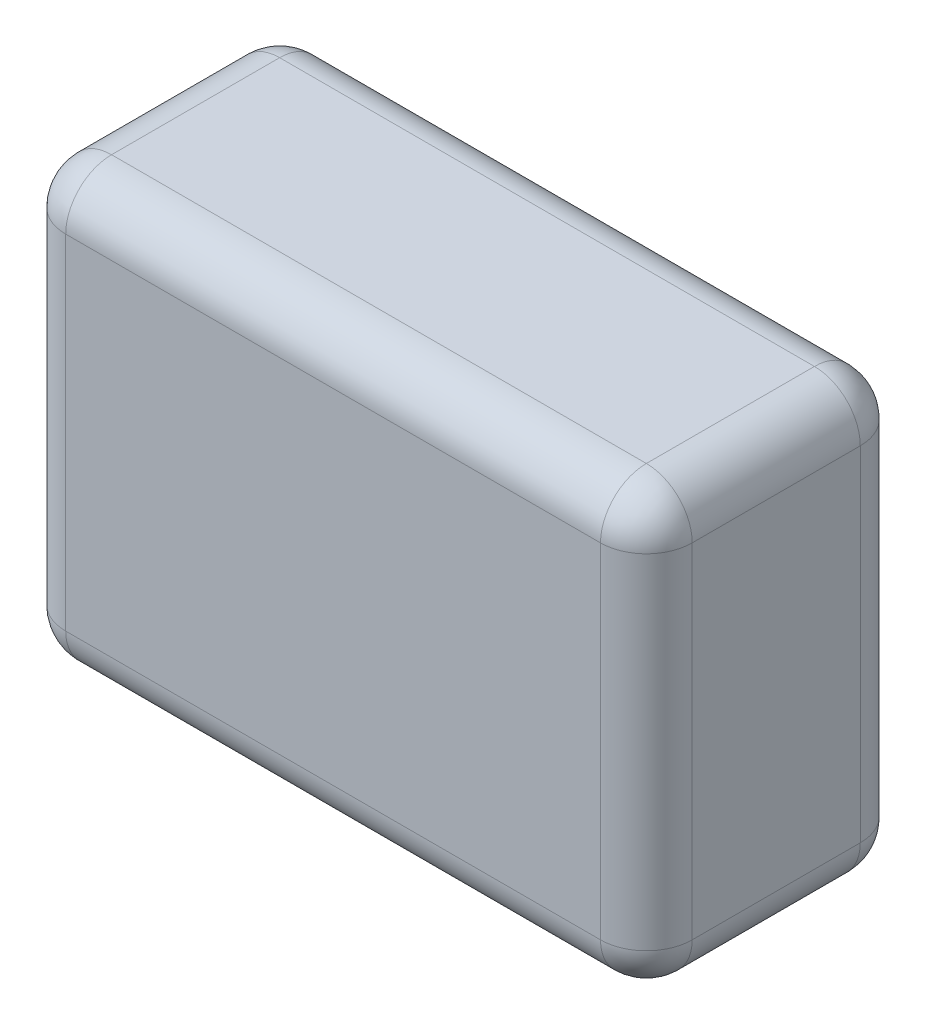
ISO-10303-21;
HEADER;
FILE_DESCRIPTION(('STEP AP214'),'2;1');
FILE_NAME('part.step','',(''),(''),'','','');
FILE_SCHEMA(('AUTOMOTIVE_DESIGN { 1 0 10303 214 1 1 1 1 }'));
ENDSEC;
DATA;
#1=APPLICATION_CONTEXT('core data for automotive mechanical design processes');
#2=APPLICATION_PROTOCOL_DEFINITION('international standard','automotive_design',2000,#1);
#3=PRODUCT_CONTEXT('',#1,'mechanical');
#4=PRODUCT('Part','Part','',(#3));
#5=PRODUCT_RELATED_PRODUCT_CATEGORY('part','',(#4));
#6=PRODUCT_DEFINITION_FORMATION('','',#4);
#7=PRODUCT_DEFINITION_CONTEXT('part definition',#1,'design');
#8=PRODUCT_DEFINITION('design','',#6,#7);
#9=PRODUCT_DEFINITION_SHAPE('','',#8);
#10=(LENGTH_UNIT() NAMED_UNIT(*) SI_UNIT(.MILLI.,.METRE.));
#11=(NAMED_UNIT(*) PLANE_ANGLE_UNIT() SI_UNIT($,.RADIAN.));
#12=(NAMED_UNIT(*) SI_UNIT($,.STERADIAN.) SOLID_ANGLE_UNIT());
#13=UNCERTAINTY_MEASURE_WITH_UNIT(LENGTH_MEASURE(1.E-05),#10,'distance_accuracy_value','');
#14=(GEOMETRIC_REPRESENTATION_CONTEXT(3) GLOBAL_UNCERTAINTY_ASSIGNED_CONTEXT((#13)) GLOBAL_UNIT_ASSIGNED_CONTEXT((#10,
#11,#12)) REPRESENTATION_CONTEXT('',''));
#15=CARTESIAN_POINT('',(0.,0.,0.));
#16=DIRECTION('',(0.,0.,1.));
#17=DIRECTION('',(1.,0.,0.));
#18=AXIS2_PLACEMENT_3D('',#15,#16,#17);
#19=CARTESIAN_POINT('',(-41.,28.5,-17.));
#20=DIRECTION('',(1.,0.,0.));
#21=DIRECTION('',(0.,0.,-1.));
#22=AXIS2_PLACEMENT_3D('',#19,#20,#21);
#23=PLANE('',#22);
#24=DIRECTION('',(0.,-1.,0.));
#25=VECTOR('',#24,1.);
#26=CARTESIAN_POINT('',(-41.,28.5,11.));
#27=LINE('',#26,#25);
#28=CARTESIAN_POINT('',(-41.,-22.5,11.));
#29=VERTEX_POINT('',#28);
#30=CARTESIAN_POINT('',(-41.,22.5,11.));
#31=VERTEX_POINT('',#30);
#32=EDGE_CURVE('E138',#29,#31,#27,.F.);
#33=ORIENTED_EDGE('',*,*,#32,.T.);
#34=DIRECTION('',(0.,0.,1.));
#35=VECTOR('',#34,1.);
#36=CARTESIAN_POINT('',(-41.,22.5,-17.));
#37=LINE('',#36,#35);
#38=CARTESIAN_POINT('',(-41.,22.5,-11.));
#39=VERTEX_POINT('',#38);
#40=EDGE_CURVE('E175',#31,#39,#37,.F.);
#41=ORIENTED_EDGE('',*,*,#40,.T.);
#42=DIRECTION('',(0.,-1.,0.));
#43=VECTOR('',#42,1.);
#44=CARTESIAN_POINT('',(-41.,28.5,-11.));
#45=LINE('',#44,#43);
#46=CARTESIAN_POINT('',(-41.,-22.5,-11.));
#47=VERTEX_POINT('',#46);
#48=EDGE_CURVE('E172',#39,#47,#45,.T.);
#49=ORIENTED_EDGE('',*,*,#48,.T.);
#50=DIRECTION('',(0.,0.,1.));
#51=VECTOR('',#50,1.);
#52=CARTESIAN_POINT('',(-41.,-22.5,-17.));
#53=LINE('',#52,#51);
#54=EDGE_CURVE('E167',#47,#29,#53,.T.);
#55=ORIENTED_EDGE('',*,*,#54,.T.);
#56=EDGE_LOOP('',(#33,#41,#49,#55));
#57=FACE_BOUND('',#56,.T.);
#58=ADVANCED_FACE('F43',(#57),#23,.F.);
#59=CARTESIAN_POINT('',(-41.,28.5,17.));
#60=DIRECTION('',(0.,0.,-1.));
#61=DIRECTION('',(-1.,0.,0.));
#62=AXIS2_PLACEMENT_3D('',#59,#60,#61);
#63=PLANE('',#62);
#64=DIRECTION('',(0.,-1.,0.));
#65=VECTOR('',#64,1.);
#66=CARTESIAN_POINT('',(35.,28.5,17.));
#67=LINE('',#66,#65);
#68=CARTESIAN_POINT('',(35.,-22.5,17.));
#69=VERTEX_POINT('',#68);
#70=CARTESIAN_POINT('',(35.,22.5,17.));
#71=VERTEX_POINT('',#70);
#72=EDGE_CURVE('E160',#69,#71,#67,.F.);
#73=ORIENTED_EDGE('',*,*,#72,.T.);
#74=DIRECTION('',(1.,0.,0.));
#75=VECTOR('',#74,1.);
#76=CARTESIAN_POINT('',(-41.,22.5,17.));
#77=LINE('',#76,#75);
#78=CARTESIAN_POINT('',(-35.,22.5,17.));
#79=VERTEX_POINT('',#78);
#80=EDGE_CURVE('E164',#71,#79,#77,.F.);
#81=ORIENTED_EDGE('',*,*,#80,.T.);
#82=DIRECTION('',(0.,-1.,0.));
#83=VECTOR('',#82,1.);
#84=CARTESIAN_POINT('',(-35.,28.5,17.));
#85=LINE('',#84,#83);
#86=CARTESIAN_POINT('',(-35.,-22.5,17.));
#87=VERTEX_POINT('',#86);
#88=EDGE_CURVE('E136',#79,#87,#85,.T.);
#89=ORIENTED_EDGE('',*,*,#88,.T.);
#90=DIRECTION('',(1.,0.,0.));
#91=VECTOR('',#90,1.);
#92=CARTESIAN_POINT('',(-41.,-22.5,17.));
#93=LINE('',#92,#91);
#94=EDGE_CURVE('E154',#87,#69,#93,.T.);
#95=ORIENTED_EDGE('',*,*,#94,.T.);
#96=EDGE_LOOP('',(#73,#81,#89,#95));
#97=FACE_BOUND('',#96,.T.);
#98=ADVANCED_FACE('F162',(#97),#63,.F.);
#99=CARTESIAN_POINT('',(41.,28.5,-17.));
#100=DIRECTION('',(-1.,0.,0.));
#101=DIRECTION('',(0.,0.,1.));
#102=AXIS2_PLACEMENT_3D('',#99,#100,#101);
#103=PLANE('',#102);
#104=DIRECTION('',(0.,-1.,0.));
#105=VECTOR('',#104,1.);
#106=CARTESIAN_POINT('',(41.,28.5,-11.));
#107=LINE('',#106,#105);
#108=CARTESIAN_POINT('',(41.,-22.5,-11.));
#109=VERTEX_POINT('',#108);
#110=CARTESIAN_POINT('',(41.,22.5,-11.));
#111=VERTEX_POINT('',#110);
#112=EDGE_CURVE('E179',#109,#111,#107,.F.);
#113=ORIENTED_EDGE('',*,*,#112,.T.);
#114=DIRECTION('',(0.,0.,-1.));
#115=VECTOR('',#114,1.);
#116=CARTESIAN_POINT('',(41.,22.5,17.));
#117=LINE('',#116,#115);
#118=CARTESIAN_POINT('',(41.,22.5,11.));
#119=VERTEX_POINT('',#118);
#120=EDGE_CURVE('E184',#111,#119,#117,.F.);
#121=ORIENTED_EDGE('',*,*,#120,.T.);
#122=DIRECTION('',(0.,-1.,0.));
#123=VECTOR('',#122,1.);
#124=CARTESIAN_POINT('',(41.,28.5,11.));
#125=LINE('',#124,#123);
#126=CARTESIAN_POINT('',(41.,-22.5,11.));
#127=VERTEX_POINT('',#126);
#128=EDGE_CURVE('E181',#119,#127,#125,.T.);
#129=ORIENTED_EDGE('',*,*,#128,.T.);
#130=DIRECTION('',(0.,0.,-1.));
#131=VECTOR('',#130,1.);
#132=CARTESIAN_POINT('',(41.,-22.5,-17.));
#133=LINE('',#132,#131);
#134=EDGE_CURVE('E177',#127,#109,#133,.T.);
#135=ORIENTED_EDGE('',*,*,#134,.T.);
#136=EDGE_LOOP('',(#113,#121,#129,#135));
#137=FACE_BOUND('',#136,.T.);
#138=ADVANCED_FACE('F289',(#137),#103,.F.);
#139=CARTESIAN_POINT('',(-41.,28.5,-17.));
#140=DIRECTION('',(0.,0.,1.));
#141=DIRECTION('',(1.,0.,0.));
#142=AXIS2_PLACEMENT_3D('',#139,#140,#141);
#143=PLANE('',#142);
#144=DIRECTION('',(0.,-1.,0.));
#145=VECTOR('',#144,1.);
#146=CARTESIAN_POINT('',(-35.,28.5,-17.));
#147=LINE('',#146,#145);
#148=CARTESIAN_POINT('',(-35.,-22.5,-17.));
#149=VERTEX_POINT('',#148);
#150=CARTESIAN_POINT('',(-35.,22.5,-17.));
#151=VERTEX_POINT('',#150);
#152=EDGE_CURVE('E188',#149,#151,#147,.F.);
#153=ORIENTED_EDGE('',*,*,#152,.T.);
#154=DIRECTION('',(-1.,0.,0.));
#155=VECTOR('',#154,1.);
#156=CARTESIAN_POINT('',(41.,22.5,-17.));
#157=LINE('',#156,#155);
#158=CARTESIAN_POINT('',(35.,22.5,-17.));
#159=VERTEX_POINT('',#158);
#160=EDGE_CURVE('E193',#151,#159,#157,.F.);
#161=ORIENTED_EDGE('',*,*,#160,.T.);
#162=DIRECTION('',(0.,-1.,0.));
#163=VECTOR('',#162,1.);
#164=CARTESIAN_POINT('',(35.,28.5,-17.));
#165=LINE('',#164,#163);
#166=CARTESIAN_POINT('',(35.,-22.5,-17.));
#167=VERTEX_POINT('',#166);
#168=EDGE_CURVE('E190',#159,#167,#165,.T.);
#169=ORIENTED_EDGE('',*,*,#168,.T.);
#170=DIRECTION('',(-1.,0.,0.));
#171=VECTOR('',#170,1.);
#172=CARTESIAN_POINT('',(-41.,-22.5,-17.));
#173=LINE('',#172,#171);
#174=EDGE_CURVE('E186',#167,#149,#173,.T.);
#175=ORIENTED_EDGE('',*,*,#174,.T.);
#176=EDGE_LOOP('',(#153,#161,#169,#175));
#177=FACE_BOUND('',#176,.T.);
#178=ADVANCED_FACE('F299',(#177),#143,.F.);
#179=CARTESIAN_POINT('',(0.,28.5,0.));
#180=DIRECTION('',(0.,1.,0.));
#181=DIRECTION('',(0.,0.,1.));
#182=AXIS2_PLACEMENT_3D('',#179,#180,#181);
#183=PLANE('',#182);
#184=DIRECTION('',(0.,0.,-1.));
#185=VECTOR('',#184,1.);
#186=CARTESIAN_POINT('',(35.,28.5,-17.));
#187=LINE('',#186,#185);
#188=CARTESIAN_POINT('',(35.,28.5,11.));
#189=VERTEX_POINT('',#188);
#190=CARTESIAN_POINT('',(35.,28.5,-11.));
#191=VERTEX_POINT('',#190);
#192=EDGE_CURVE('E199',#189,#191,#187,.T.);
#193=ORIENTED_EDGE('',*,*,#192,.T.);
#194=DIRECTION('',(-1.,0.,0.));
#195=VECTOR('',#194,1.);
#196=CARTESIAN_POINT('',(-41.,28.5,-11.));
#197=LINE('',#196,#195);
#198=CARTESIAN_POINT('',(-35.,28.5,-11.));
#199=VERTEX_POINT('',#198);
#200=EDGE_CURVE('E201',#191,#199,#197,.T.);
#201=ORIENTED_EDGE('',*,*,#200,.T.);
#202=DIRECTION('',(0.,0.,1.));
#203=VECTOR('',#202,1.);
#204=CARTESIAN_POINT('',(-35.,28.5,17.));
#205=LINE('',#204,#203);
#206=CARTESIAN_POINT('',(-35.,28.5,11.));
#207=VERTEX_POINT('',#206);
#208=EDGE_CURVE('E195',#199,#207,#205,.T.);
#209=ORIENTED_EDGE('',*,*,#208,.T.);
#210=DIRECTION('',(1.,0.,0.));
#211=VECTOR('',#210,1.);
#212=CARTESIAN_POINT('',(41.,28.5,11.));
#213=LINE('',#212,#211);
#214=EDGE_CURVE('E197',#207,#189,#213,.T.);
#215=ORIENTED_EDGE('',*,*,#214,.T.);
#216=EDGE_LOOP('',(#193,#201,#209,#215));
#217=FACE_BOUND('',#216,.T.);
#218=ADVANCED_FACE('F281',(#217),#183,.T.);
#219=CARTESIAN_POINT('',(0.,-28.5,0.));
#220=DIRECTION('',(0.,1.,0.));
#221=DIRECTION('',(0.,0.,1.));
#222=AXIS2_PLACEMENT_3D('',#219,#220,#221);
#223=PLANE('',#222);
#224=DIRECTION('',(0.,0.,1.));
#225=VECTOR('',#224,1.);
#226=CARTESIAN_POINT('',(-35.,-28.5,0.));
#227=LINE('',#226,#225);
#228=CARTESIAN_POINT('',(-35.,-28.5,11.));
#229=VERTEX_POINT('',#228);
#230=CARTESIAN_POINT('',(-35.,-28.5,-11.));
#231=VERTEX_POINT('',#230);
#232=EDGE_CURVE('E204',#229,#231,#227,.F.);
#233=ORIENTED_EDGE('',*,*,#232,.T.);
#234=DIRECTION('',(-1.,0.,0.));
#235=VECTOR('',#234,1.);
#236=CARTESIAN_POINT('',(0.,-28.5,-11.));
#237=LINE('',#236,#235);
#238=CARTESIAN_POINT('',(35.,-28.5,-11.));
#239=VERTEX_POINT('',#238);
#240=EDGE_CURVE('E11',#231,#239,#237,.F.);
#241=ORIENTED_EDGE('',*,*,#240,.T.);
#242=DIRECTION('',(0.,0.,-1.));
#243=VECTOR('',#242,1.);
#244=CARTESIAN_POINT('',(35.,-28.5,0.));
#245=LINE('',#244,#243);
#246=CARTESIAN_POINT('',(35.,-28.5,11.));
#247=VERTEX_POINT('',#246);
#248=EDGE_CURVE('E52',#239,#247,#245,.F.);
#249=ORIENTED_EDGE('',*,*,#248,.T.);
#250=DIRECTION('',(1.,0.,0.));
#251=VECTOR('',#250,1.);
#252=CARTESIAN_POINT('',(0.,-28.5,11.));
#253=LINE('',#252,#251);
#254=EDGE_CURVE('E206',#247,#229,#253,.F.);
#255=ORIENTED_EDGE('',*,*,#254,.T.);
#256=EDGE_LOOP('',(#233,#241,#249,#255));
#257=FACE_BOUND('',#256,.T.);
#258=ADVANCED_FACE('F487',(#257),#223,.F.);
#259=CARTESIAN_POINT('',(35.,28.5,-11.));
#260=DIRECTION('',(0.,-1.,0.));
#261=DIRECTION('',(0.,0.,-1.));
#262=AXIS2_PLACEMENT_3D('',#259,#260,#261);
#263=CYLINDRICAL_SURFACE('',#262,6.);
#264=CARTESIAN_POINT('',(35.,22.5,-11.));
#265=DIRECTION('',(0.,1.,0.));
#266=DIRECTION('',(0.,0.,1.));
#267=AXIS2_PLACEMENT_3D('',#264,#265,#266);
#268=CIRCLE('',#267,6.);
#269=EDGE_CURVE('E47',#111,#159,#268,.T.);
#270=ORIENTED_EDGE('',*,*,#269,.F.);
#271=ORIENTED_EDGE('',*,*,#112,.F.);
#272=CARTESIAN_POINT('',(35.,-22.5,-11.));
#273=DIRECTION('',(0.,-1.,0.));
#274=DIRECTION('',(0.,0.,-1.));
#275=AXIS2_PLACEMENT_3D('',#272,#273,#274);
#276=CIRCLE('',#275,6.);
#277=EDGE_CURVE('E259',#167,#109,#276,.T.);
#278=ORIENTED_EDGE('',*,*,#277,.F.);
#279=ORIENTED_EDGE('',*,*,#168,.F.);
#280=EDGE_LOOP('',(#270,#271,#278,#279));
#281=FACE_BOUND('',#280,.T.);
#282=ADVANCED_FACE('F45',(#281),#263,.T.);
#283=CARTESIAN_POINT('',(35.,22.5,-11.));
#284=DIRECTION('',(0.,0.,-1.));
#285=DIRECTION('',(-1.,0.,0.));
#286=AXIS2_PLACEMENT_3D('',#283,#284,#285);
#287=SPHERICAL_SURFACE('',#286,6.);
#288=CARTESIAN_POINT('',(35.,22.5,-11.));
#289=DIRECTION('',(0.,0.,-1.));
#290=DIRECTION('',(-1.,0.,0.));
#291=AXIS2_PLACEMENT_3D('',#288,#289,#290);
#292=CIRCLE('',#291,6.);
#293=EDGE_CURVE('E254',#111,#191,#292,.F.);
#294=ORIENTED_EDGE('',*,*,#293,.F.);
#295=ORIENTED_EDGE('',*,*,#269,.T.);
#296=CARTESIAN_POINT('',(35.,22.5,-11.));
#297=DIRECTION('',(1.,0.,0.));
#298=DIRECTION('',(0.,1.,0.));
#299=AXIS2_PLACEMENT_3D('',#296,#297,#298);
#300=CIRCLE('',#299,6.);
#301=EDGE_CURVE('E257',#191,#159,#300,.F.);
#302=ORIENTED_EDGE('',*,*,#301,.F.);
#303=EDGE_LOOP('',(#294,#295,#302));
#304=FACE_BOUND('',#303,.T.);
#305=ADVANCED_FACE('F269',(#304),#287,.T.);
#306=CARTESIAN_POINT('',(35.,-22.5,-11.));
#307=DIRECTION('',(1.,0.,0.));
#308=DIRECTION('',(0.,1.,0.));
#309=AXIS2_PLACEMENT_3D('',#306,#307,#308);
#310=SPHERICAL_SURFACE('',#309,6.);
#311=CARTESIAN_POINT('',(35.,-22.5,-11.));
#312=DIRECTION('',(1.,0.,0.));
#313=DIRECTION('',(0.,0.,-1.));
#314=AXIS2_PLACEMENT_3D('',#311,#312,#313);
#315=CIRCLE('',#314,6.);
#316=EDGE_CURVE('E249',#167,#239,#315,.F.);
#317=ORIENTED_EDGE('',*,*,#316,.F.);
#318=ORIENTED_EDGE('',*,*,#277,.T.);
#319=CARTESIAN_POINT('',(35.,-22.5,-11.));
#320=DIRECTION('',(0.,0.,-1.));
#321=DIRECTION('',(-1.,0.,0.));
#322=AXIS2_PLACEMENT_3D('',#319,#320,#321);
#323=CIRCLE('',#322,6.);
#324=EDGE_CURVE('E252',#239,#109,#323,.F.);
#325=ORIENTED_EDGE('',*,*,#324,.F.);
#326=EDGE_LOOP('',(#317,#318,#325));
#327=FACE_BOUND('',#326,.T.);
#328=ADVANCED_FACE('F466',(#327),#310,.T.);
#329=CARTESIAN_POINT('',(0.,22.5,-11.));
#330=DIRECTION('',(1.,0.,0.));
#331=DIRECTION('',(0.,0.,-1.));
#332=AXIS2_PLACEMENT_3D('',#329,#330,#331);
#333=CYLINDRICAL_SURFACE('',#332,6.);
#334=ORIENTED_EDGE('',*,*,#301,.T.);
#335=ORIENTED_EDGE('',*,*,#160,.F.);
#336=CARTESIAN_POINT('',(-35.,22.5,-11.));
#337=DIRECTION('',(-1.,0.,0.));
#338=DIRECTION('',(0.,0.,1.));
#339=AXIS2_PLACEMENT_3D('',#336,#337,#338);
#340=CIRCLE('',#339,6.);
#341=EDGE_CURVE('E243',#199,#151,#340,.T.);
#342=ORIENTED_EDGE('',*,*,#341,.F.);
#343=ORIENTED_EDGE('',*,*,#200,.F.);
#344=EDGE_LOOP('',(#334,#335,#342,#343));
#345=FACE_BOUND('',#344,.T.);
#346=ADVANCED_FACE('F277',(#345),#333,.T.);
#347=CARTESIAN_POINT('',(35.,22.5,0.));
#348=DIRECTION('',(0.,0.,1.));
#349=DIRECTION('',(1.,0.,0.));
#350=AXIS2_PLACEMENT_3D('',#347,#348,#349);
#351=CYLINDRICAL_SURFACE('',#350,6.);
#352=ORIENTED_EDGE('',*,*,#293,.T.);
#353=ORIENTED_EDGE('',*,*,#192,.F.);
#354=CARTESIAN_POINT('',(35.,22.5,11.));
#355=DIRECTION('',(0.,0.,1.));
#356=DIRECTION('',(1.,0.,0.));
#357=AXIS2_PLACEMENT_3D('',#354,#355,#356);
#358=CIRCLE('',#357,6.);
#359=EDGE_CURVE('E240',#119,#189,#358,.T.);
#360=ORIENTED_EDGE('',*,*,#359,.F.);
#361=ORIENTED_EDGE('',*,*,#120,.F.);
#362=EDGE_LOOP('',(#352,#353,#360,#361));
#363=FACE_BOUND('',#362,.T.);
#364=ADVANCED_FACE('F286',(#363),#351,.T.);
#365=CARTESIAN_POINT('',(35.,28.5,11.));
#366=DIRECTION('',(0.,-1.,0.));
#367=DIRECTION('',(0.,0.,-1.));
#368=AXIS2_PLACEMENT_3D('',#365,#366,#367);
#369=CYLINDRICAL_SURFACE('',#368,6.);
#370=CARTESIAN_POINT('',(35.,-22.5,11.));
#371=DIRECTION('',(0.,-1.,0.));
#372=DIRECTION('',(0.,0.,-1.));
#373=AXIS2_PLACEMENT_3D('',#370,#371,#372);
#374=CIRCLE('',#373,6.);
#375=EDGE_CURVE('E234',#127,#69,#374,.T.);
#376=ORIENTED_EDGE('',*,*,#375,.F.);
#377=ORIENTED_EDGE('',*,*,#128,.F.);
#378=CARTESIAN_POINT('',(35.,22.5,11.));
#379=DIRECTION('',(0.,1.,0.));
#380=DIRECTION('',(0.,0.,1.));
#381=AXIS2_PLACEMENT_3D('',#378,#379,#380);
#382=CIRCLE('',#381,6.);
#383=EDGE_CURVE('E237',#71,#119,#382,.T.);
#384=ORIENTED_EDGE('',*,*,#383,.F.);
#385=ORIENTED_EDGE('',*,*,#72,.F.);
#386=EDGE_LOOP('',(#376,#377,#384,#385));
#387=FACE_BOUND('',#386,.T.);
#388=ADVANCED_FACE('F293',(#387),#369,.T.);
#389=CARTESIAN_POINT('',(35.,-22.5,-17.));
#390=DIRECTION('',(0.,0.,-1.));
#391=DIRECTION('',(-1.,0.,0.));
#392=AXIS2_PLACEMENT_3D('',#389,#390,#391);
#393=CYLINDRICAL_SURFACE('',#392,6.);
#394=ORIENTED_EDGE('',*,*,#324,.T.);
#395=ORIENTED_EDGE('',*,*,#134,.F.);
#396=CARTESIAN_POINT('',(35.,-22.5,11.));
#397=DIRECTION('',(0.,0.,1.));
#398=DIRECTION('',(1.,0.,0.));
#399=AXIS2_PLACEMENT_3D('',#396,#397,#398);
#400=CIRCLE('',#399,6.);
#401=EDGE_CURVE('E232',#247,#127,#400,.T.);
#402=ORIENTED_EDGE('',*,*,#401,.F.);
#403=ORIENTED_EDGE('',*,*,#248,.F.);
#404=EDGE_LOOP('',(#394,#395,#402,#403));
#405=FACE_BOUND('',#404,.T.);
#406=ADVANCED_FACE('F297',(#405),#393,.T.);
#407=CARTESIAN_POINT('',(-41.,-22.5,-11.));
#408=DIRECTION('',(-1.,0.,0.));
#409=DIRECTION('',(0.,0.,1.));
#410=AXIS2_PLACEMENT_3D('',#407,#408,#409);
#411=CYLINDRICAL_SURFACE('',#410,6.);
#412=ORIENTED_EDGE('',*,*,#316,.T.);
#413=ORIENTED_EDGE('',*,*,#240,.F.);
#414=CARTESIAN_POINT('',(-35.,-22.5,-11.));
#415=DIRECTION('',(-1.,0.,0.));
#416=DIRECTION('',(0.,0.,1.));
#417=AXIS2_PLACEMENT_3D('',#414,#415,#416);
#418=CIRCLE('',#417,6.);
#419=EDGE_CURVE('E229',#149,#231,#418,.T.);
#420=ORIENTED_EDGE('',*,*,#419,.F.);
#421=ORIENTED_EDGE('',*,*,#174,.F.);
#422=EDGE_LOOP('',(#412,#413,#420,#421));
#423=FACE_BOUND('',#422,.T.);
#424=ADVANCED_FACE('F309',(#423),#411,.T.);
#425=CARTESIAN_POINT('',(-35.,28.5,-11.));
#426=DIRECTION('',(0.,-1.,0.));
#427=DIRECTION('',(0.,0.,-1.));
#428=AXIS2_PLACEMENT_3D('',#425,#426,#427);
#429=CYLINDRICAL_SURFACE('',#428,6.);
#430=CARTESIAN_POINT('',(-35.,22.5,-11.));
#431=DIRECTION('',(0.,1.,0.));
#432=DIRECTION('',(0.,0.,1.));
#433=AXIS2_PLACEMENT_3D('',#430,#431,#432);
#434=CIRCLE('',#433,6.);
#435=EDGE_CURVE('E246',#151,#39,#434,.T.);
#436=ORIENTED_EDGE('',*,*,#435,.F.);
#437=ORIENTED_EDGE('',*,*,#152,.F.);
#438=CARTESIAN_POINT('',(-35.,-22.5,-11.));
#439=DIRECTION('',(0.,-1.,0.));
#440=DIRECTION('',(0.,0.,-1.));
#441=AXIS2_PLACEMENT_3D('',#438,#439,#440);
#442=CIRCLE('',#441,6.);
#443=EDGE_CURVE('E226',#47,#149,#442,.T.);
#444=ORIENTED_EDGE('',*,*,#443,.F.);
#445=ORIENTED_EDGE('',*,*,#48,.F.);
#446=EDGE_LOOP('',(#436,#437,#444,#445));
#447=FACE_BOUND('',#446,.T.);
#448=ADVANCED_FACE('F304',(#447),#429,.T.);
#449=CARTESIAN_POINT('',(-35.,22.5,-11.));
#450=DIRECTION('',(0.,0.,-1.));
#451=DIRECTION('',(-1.,0.,0.));
#452=AXIS2_PLACEMENT_3D('',#449,#450,#451);
#453=SPHERICAL_SURFACE('',#452,6.);
#454=ORIENTED_EDGE('',*,*,#341,.T.);
#455=ORIENTED_EDGE('',*,*,#435,.T.);
#456=CARTESIAN_POINT('',(-35.,22.5,-11.));
#457=DIRECTION('',(0.,0.,-1.));
#458=DIRECTION('',(-1.,0.,0.));
#459=AXIS2_PLACEMENT_3D('',#456,#457,#458);
#460=CIRCLE('',#459,6.);
#461=EDGE_CURVE('E223',#199,#39,#460,.F.);
#462=ORIENTED_EDGE('',*,*,#461,.F.);
#463=EDGE_LOOP('',(#454,#455,#462));
#464=FACE_BOUND('',#463,.T.);
#465=ADVANCED_FACE('F320',(#464),#453,.T.);
#466=CARTESIAN_POINT('',(35.,22.5,11.));
#467=DIRECTION('',(1.,0.,0.));
#468=DIRECTION('',(0.,0.,-1.));
#469=AXIS2_PLACEMENT_3D('',#466,#467,#468);
#470=SPHERICAL_SURFACE('',#469,6.);
#471=ORIENTED_EDGE('',*,*,#383,.T.);
#472=ORIENTED_EDGE('',*,*,#359,.T.);
#473=CARTESIAN_POINT('',(35.,22.5,11.));
#474=DIRECTION('',(1.,0.,0.));
#475=DIRECTION('',(0.,0.,-1.));
#476=AXIS2_PLACEMENT_3D('',#473,#474,#475);
#477=CIRCLE('',#476,6.);
#478=EDGE_CURVE('E220',#71,#189,#477,.F.);
#479=ORIENTED_EDGE('',*,*,#478,.F.);
#480=EDGE_LOOP('',(#471,#472,#479));
#481=FACE_BOUND('',#480,.T.);
#482=ADVANCED_FACE('F330',(#481),#470,.T.);
#483=CARTESIAN_POINT('',(35.,-22.5,11.));
#484=DIRECTION('',(1.,0.,0.));
#485=DIRECTION('',(0.,1.,0.));
#486=AXIS2_PLACEMENT_3D('',#483,#484,#485);
#487=SPHERICAL_SURFACE('',#486,6.);
#488=ORIENTED_EDGE('',*,*,#401,.T.);
#489=ORIENTED_EDGE('',*,*,#375,.T.);
#490=CARTESIAN_POINT('',(35.,-22.5,11.));
#491=DIRECTION('',(1.,0.,0.));
#492=DIRECTION('',(0.,0.,-1.));
#493=AXIS2_PLACEMENT_3D('',#490,#491,#492);
#494=CIRCLE('',#493,6.);
#495=EDGE_CURVE('E157',#247,#69,#494,.F.);
#496=ORIENTED_EDGE('',*,*,#495,.F.);
#497=EDGE_LOOP('',(#488,#489,#496));
#498=FACE_BOUND('',#497,.T.);
#499=ADVANCED_FACE('F332',(#498),#487,.T.);
#500=CARTESIAN_POINT('',(-35.,-22.5,-11.));
#501=DIRECTION('',(0.,0.,-1.));
#502=DIRECTION('',(0.,1.,0.));
#503=AXIS2_PLACEMENT_3D('',#500,#501,#502);
#504=SPHERICAL_SURFACE('',#503,6.);
#505=ORIENTED_EDGE('',*,*,#443,.T.);
#506=ORIENTED_EDGE('',*,*,#419,.T.);
#507=CARTESIAN_POINT('',(-35.,-22.5,-11.));
#508=DIRECTION('',(0.,0.,-1.));
#509=DIRECTION('',(-1.,0.,0.));
#510=AXIS2_PLACEMENT_3D('',#507,#508,#509);
#511=CIRCLE('',#510,6.);
#512=EDGE_CURVE('E216',#47,#231,#511,.F.);
#513=ORIENTED_EDGE('',*,*,#512,.F.);
#514=EDGE_LOOP('',(#505,#506,#513));
#515=FACE_BOUND('',#514,.T.);
#516=ADVANCED_FACE('F311',(#515),#504,.T.);
#517=CARTESIAN_POINT('',(-35.,22.5,0.));
#518=DIRECTION('',(0.,0.,-1.));
#519=DIRECTION('',(-1.,0.,0.));
#520=AXIS2_PLACEMENT_3D('',#517,#518,#519);
#521=CYLINDRICAL_SURFACE('',#520,6.);
#522=ORIENTED_EDGE('',*,*,#461,.T.);
#523=ORIENTED_EDGE('',*,*,#40,.F.);
#524=CARTESIAN_POINT('',(-35.,22.5,11.));
#525=DIRECTION('',(0.,0.,1.));
#526=DIRECTION('',(1.,0.,0.));
#527=AXIS2_PLACEMENT_3D('',#524,#525,#526);
#528=CIRCLE('',#527,6.);
#529=EDGE_CURVE('E213',#207,#31,#528,.T.);
#530=ORIENTED_EDGE('',*,*,#529,.F.);
#531=ORIENTED_EDGE('',*,*,#208,.F.);
#532=EDGE_LOOP('',(#522,#523,#530,#531));
#533=FACE_BOUND('',#532,.T.);
#534=ADVANCED_FACE('F322',(#533),#521,.T.);
#535=CARTESIAN_POINT('',(0.,22.5,11.));
#536=DIRECTION('',(-1.,0.,0.));
#537=DIRECTION('',(0.,0.,1.));
#538=AXIS2_PLACEMENT_3D('',#535,#536,#537);
#539=CYLINDRICAL_SURFACE('',#538,6.);
#540=ORIENTED_EDGE('',*,*,#478,.T.);
#541=ORIENTED_EDGE('',*,*,#214,.F.);
#542=CARTESIAN_POINT('',(-35.,22.5,11.));
#543=DIRECTION('',(-1.,0.,0.));
#544=DIRECTION('',(0.,0.,1.));
#545=AXIS2_PLACEMENT_3D('',#542,#543,#544);
#546=CIRCLE('',#545,6.);
#547=EDGE_CURVE('E151',#79,#207,#546,.T.);
#548=ORIENTED_EDGE('',*,*,#547,.F.);
#549=ORIENTED_EDGE('',*,*,#80,.F.);
#550=EDGE_LOOP('',(#540,#541,#548,#549));
#551=FACE_BOUND('',#550,.T.);
#552=ADVANCED_FACE('F328',(#551),#539,.T.);
#553=CARTESIAN_POINT('',(-41.,-22.5,11.));
#554=DIRECTION('',(1.,0.,0.));
#555=DIRECTION('',(0.,0.,-1.));
#556=AXIS2_PLACEMENT_3D('',#553,#554,#555);
#557=CYLINDRICAL_SURFACE('',#556,6.);
#558=ORIENTED_EDGE('',*,*,#495,.T.);
#559=ORIENTED_EDGE('',*,*,#94,.F.);
#560=CARTESIAN_POINT('',(-35.,-22.5,11.));
#561=DIRECTION('',(-1.,0.,0.));
#562=DIRECTION('',(0.,0.,1.));
#563=AXIS2_PLACEMENT_3D('',#560,#561,#562);
#564=CIRCLE('',#563,6.);
#565=EDGE_CURVE('E144',#229,#87,#564,.T.);
#566=ORIENTED_EDGE('',*,*,#565,.F.);
#567=ORIENTED_EDGE('',*,*,#254,.F.);
#568=EDGE_LOOP('',(#558,#559,#566,#567));
#569=FACE_BOUND('',#568,.T.);
#570=ADVANCED_FACE('F155',(#569),#557,.T.);
#571=CARTESIAN_POINT('',(-35.,-22.5,-17.));
#572=DIRECTION('',(0.,0.,1.));
#573=DIRECTION('',(1.,0.,0.));
#574=AXIS2_PLACEMENT_3D('',#571,#572,#573);
#575=CYLINDRICAL_SURFACE('',#574,6.);
#576=ORIENTED_EDGE('',*,*,#512,.T.);
#577=ORIENTED_EDGE('',*,*,#232,.F.);
#578=CARTESIAN_POINT('',(-35.,-22.5,11.));
#579=DIRECTION('',(0.,0.,1.));
#580=DIRECTION('',(1.,0.,0.));
#581=AXIS2_PLACEMENT_3D('',#578,#579,#580);
#582=CIRCLE('',#581,6.);
#583=EDGE_CURVE('E148',#29,#229,#582,.T.);
#584=ORIENTED_EDGE('',*,*,#583,.F.);
#585=ORIENTED_EDGE('',*,*,#54,.F.);
#586=EDGE_LOOP('',(#576,#577,#584,#585));
#587=FACE_BOUND('',#586,.T.);
#588=ADVANCED_FACE('F315',(#587),#575,.T.);
#589=CARTESIAN_POINT('',(-35.,22.5,11.));
#590=DIRECTION('',(0.,1.,0.));
#591=DIRECTION('',(0.,0.,1.));
#592=AXIS2_PLACEMENT_3D('',#589,#590,#591);
#593=SPHERICAL_SURFACE('',#592,6.);
#594=ORIENTED_EDGE('',*,*,#547,.T.);
#595=ORIENTED_EDGE('',*,*,#529,.T.);
#596=CARTESIAN_POINT('',(-35.,22.5,11.));
#597=DIRECTION('',(0.,1.,0.));
#598=DIRECTION('',(0.,0.,1.));
#599=AXIS2_PLACEMENT_3D('',#596,#597,#598);
#600=CIRCLE('',#599,6.);
#601=EDGE_CURVE('E141',#79,#31,#600,.F.);
#602=ORIENTED_EDGE('',*,*,#601,.F.);
#603=EDGE_LOOP('',(#594,#595,#602));
#604=FACE_BOUND('',#603,.T.);
#605=ADVANCED_FACE('F326',(#604),#593,.T.);
#606=CARTESIAN_POINT('',(-35.,-22.5,11.));
#607=DIRECTION('',(0.,-1.,0.));
#608=DIRECTION('',(0.,0.,-1.));
#609=AXIS2_PLACEMENT_3D('',#606,#607,#608);
#610=SPHERICAL_SURFACE('',#609,6.);
#611=ORIENTED_EDGE('',*,*,#583,.T.);
#612=ORIENTED_EDGE('',*,*,#565,.T.);
#613=CARTESIAN_POINT('',(-35.,-22.5,11.));
#614=DIRECTION('',(0.,-1.,0.));
#615=DIRECTION('',(0.,0.,-1.));
#616=AXIS2_PLACEMENT_3D('',#613,#614,#615);
#617=CIRCLE('',#616,6.);
#618=EDGE_CURVE('E132',#29,#87,#617,.F.);
#619=ORIENTED_EDGE('',*,*,#618,.F.);
#620=EDGE_LOOP('',(#611,#612,#619));
#621=FACE_BOUND('',#620,.T.);
#622=ADVANCED_FACE('F146',(#621),#610,.T.);
#623=CARTESIAN_POINT('',(-35.,28.5,11.));
#624=DIRECTION('',(0.,-1.,0.));
#625=DIRECTION('',(0.,0.,-1.));
#626=AXIS2_PLACEMENT_3D('',#623,#624,#625);
#627=CYLINDRICAL_SURFACE('',#626,6.);
#628=ORIENTED_EDGE('',*,*,#601,.T.);
#629=ORIENTED_EDGE('',*,*,#32,.F.);
#630=ORIENTED_EDGE('',*,*,#618,.T.);
#631=ORIENTED_EDGE('',*,*,#88,.F.);
#632=EDGE_LOOP('',(#628,#629,#630,#631));
#633=FACE_BOUND('',#632,.T.);
#634=ADVANCED_FACE('F134',(#633),#627,.T.);
#635=CLOSED_SHELL('',(#58,#98,#138,#178,#218,#258,#282,#305,#328,#346,#364,#388,#406,#424,#448,
#465,#482,#499,#516,#534,#552,#570,#588,#605,#622,#634));
#636=MANIFOLD_SOLID_BREP('B2',#635);
#637=ADVANCED_BREP_SHAPE_REPRESENTATION('',(#18,#636),#14);
#638=SHAPE_DEFINITION_REPRESENTATION(#9,#637);
ENDSEC;
END-ISO-10303-21;
